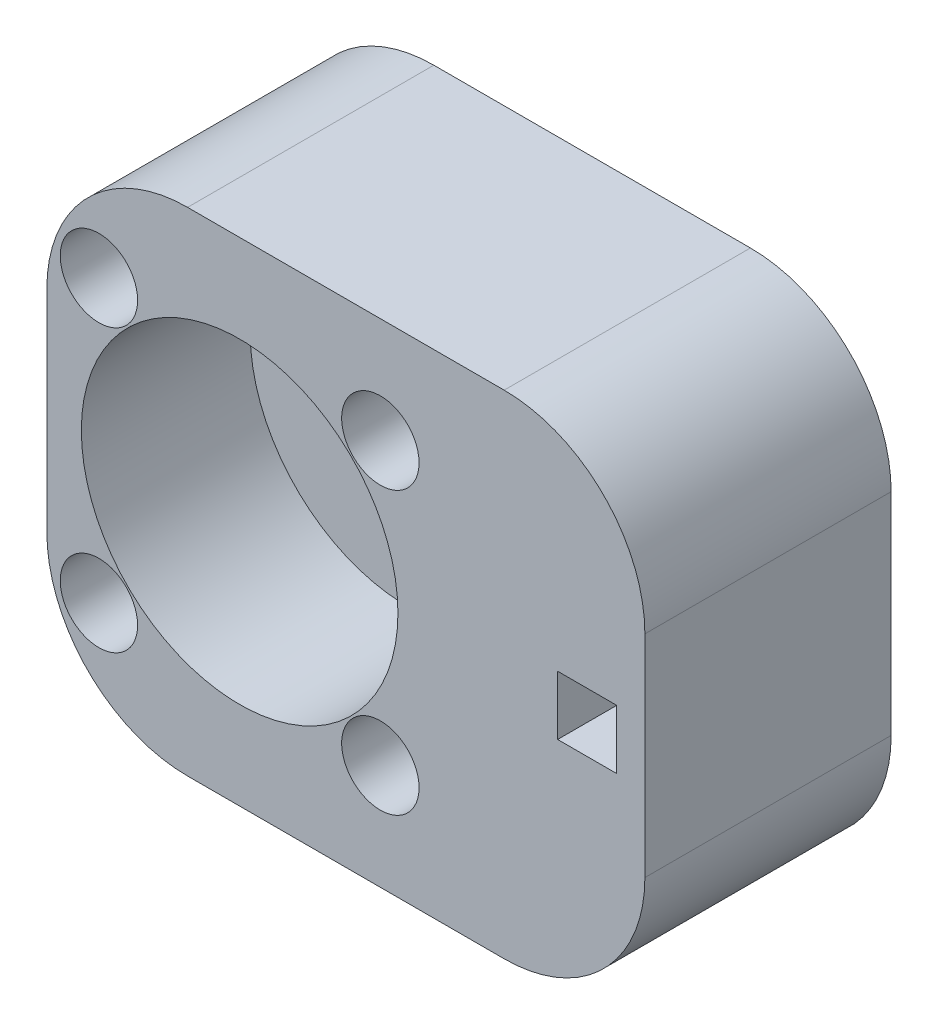
ISO-10303-21;
HEADER;
FILE_DESCRIPTION(('STEP AP214'),'2;1');
FILE_NAME('part.step','',(''),(''),'','','');
FILE_SCHEMA(('AUTOMOTIVE_DESIGN { 1 0 10303 214 1 1 1 1 }'));
ENDSEC;
DATA;
#1=APPLICATION_CONTEXT('core data for automotive mechanical design processes');
#2=APPLICATION_PROTOCOL_DEFINITION('international standard','automotive_design',2000,#1);
#3=PRODUCT_CONTEXT('',#1,'mechanical');
#4=PRODUCT('Part','Part','',(#3));
#5=PRODUCT_RELATED_PRODUCT_CATEGORY('part','',(#4));
#6=PRODUCT_DEFINITION_FORMATION('','',#4);
#7=PRODUCT_DEFINITION_CONTEXT('part definition',#1,'design');
#8=PRODUCT_DEFINITION('design','',#6,#7);
#9=PRODUCT_DEFINITION_SHAPE('','',#8);
#10=(LENGTH_UNIT() NAMED_UNIT(*) SI_UNIT(.MILLI.,.METRE.));
#11=(NAMED_UNIT(*) PLANE_ANGLE_UNIT() SI_UNIT($,.RADIAN.));
#12=(NAMED_UNIT(*) SI_UNIT($,.STERADIAN.) SOLID_ANGLE_UNIT());
#13=UNCERTAINTY_MEASURE_WITH_UNIT(LENGTH_MEASURE(1.E-05),#10,'distance_accuracy_value','');
#14=(GEOMETRIC_REPRESENTATION_CONTEXT(3) GLOBAL_UNCERTAINTY_ASSIGNED_CONTEXT((#13)) GLOBAL_UNIT_ASSIGNED_CONTEXT((#10,
#11,#12)) REPRESENTATION_CONTEXT('',''));
#15=CARTESIAN_POINT('',(0.,0.,0.));
#16=DIRECTION('',(0.,0.,1.));
#17=DIRECTION('',(1.,0.,0.));
#18=AXIS2_PLACEMENT_3D('',#15,#16,#17);
#19=CARTESIAN_POINT('',(382.450010525475,-86.87822296326,0.));
#20=DIRECTION('',(0.,0.,1.));
#21=DIRECTION('',(1.,0.,0.));
#22=AXIS2_PLACEMENT_3D('',#19,#20,#21);
#23=CYLINDRICAL_SURFACE('',#22,1.59999999833988);
#24=CARTESIAN_POINT('',(382.450010525475,-86.87822296326,0.));
#25=DIRECTION('',(0.,0.,1.));
#26=DIRECTION('',(1.,0.,0.));
#27=AXIS2_PLACEMENT_3D('',#24,#25,#26);
#28=CIRCLE('',#27,1.59999999833988);
#29=CARTESIAN_POINT('',(384.050010523815,-86.87822296326,0.));
#30=VERTEX_POINT('',#29);
#31=EDGE_CURVE('E373',#30,#30,#28,.T.);
#32=ORIENTED_EDGE('',*,*,#31,.F.);
#33=EDGE_LOOP('',(#32));
#34=FACE_BOUND('',#33,.T.);
#35=CARTESIAN_POINT('',(382.450010525475,-86.87822296326,2.5));
#36=DIRECTION('',(0.,0.,1.));
#37=DIRECTION('',(1.,0.,0.));
#38=AXIS2_PLACEMENT_3D('',#35,#36,#37);
#39=CIRCLE('',#38,1.59999999833988);
#40=CARTESIAN_POINT('',(384.050010523815,-86.87822296326,2.5));
#41=VERTEX_POINT('',#40);
#42=EDGE_CURVE('E201',#41,#41,#39,.F.);
#43=ORIENTED_EDGE('',*,*,#42,.F.);
#44=EDGE_LOOP('',(#43));
#45=FACE_BOUND('',#44,.T.);
#46=ADVANCED_FACE('F39',(#34,#45),#23,.F.);
#47=CARTESIAN_POINT('',(362.450010525475,-106.87822296326,0.));
#48=DIRECTION('',(0.,0.,1.));
#49=DIRECTION('',(1.,0.,0.));
#50=AXIS2_PLACEMENT_3D('',#47,#48,#49);
#51=CYLINDRICAL_SURFACE('',#50,1.59999999979241);
#52=CARTESIAN_POINT('',(362.450010525475,-106.87822296326,0.));
#53=DIRECTION('',(0.,0.,1.));
#54=DIRECTION('',(1.,0.,0.));
#55=AXIS2_PLACEMENT_3D('',#52,#53,#54);
#56=CIRCLE('',#55,1.59999999979241);
#57=CARTESIAN_POINT('',(364.050010525267,-106.87822296326,0.));
#58=VERTEX_POINT('',#57);
#59=EDGE_CURVE('E204',#58,#58,#56,.T.);
#60=ORIENTED_EDGE('',*,*,#59,.F.);
#61=EDGE_LOOP('',(#60));
#62=FACE_BOUND('',#61,.T.);
#63=CARTESIAN_POINT('',(362.450010525475,-106.87822296326,2.5));
#64=DIRECTION('',(0.,0.,1.));
#65=DIRECTION('',(1.,0.,0.));
#66=AXIS2_PLACEMENT_3D('',#63,#64,#65);
#67=CIRCLE('',#66,1.59999999979241);
#68=CARTESIAN_POINT('',(364.050010525267,-106.87822296326,2.5));
#69=VERTEX_POINT('',#68);
#70=EDGE_CURVE('E198',#69,#69,#67,.F.);
#71=ORIENTED_EDGE('',*,*,#70,.F.);
#72=EDGE_LOOP('',(#71));
#73=FACE_BOUND('',#72,.T.);
#74=ADVANCED_FACE('F270',(#62,#73),#51,.F.);
#75=CARTESIAN_POINT('',(362.450010525475,-86.87822296326,0.));
#76=DIRECTION('',(0.,0.,1.));
#77=DIRECTION('',(1.,0.,0.));
#78=AXIS2_PLACEMENT_3D('',#75,#76,#77);
#79=CYLINDRICAL_SURFACE('',#78,1.59999999833988);
#80=CARTESIAN_POINT('',(362.450010525475,-86.87822296326,0.));
#81=DIRECTION('',(0.,0.,1.));
#82=DIRECTION('',(1.,0.,0.));
#83=AXIS2_PLACEMENT_3D('',#80,#81,#82);
#84=CIRCLE('',#83,1.59999999833988);
#85=CARTESIAN_POINT('',(364.050010523815,-86.87822296326,0.));
#86=VERTEX_POINT('',#85);
#87=EDGE_CURVE('E374',#86,#86,#84,.T.);
#88=ORIENTED_EDGE('',*,*,#87,.F.);
#89=EDGE_LOOP('',(#88));
#90=FACE_BOUND('',#89,.T.);
#91=CARTESIAN_POINT('',(362.450010525475,-86.87822296326,2.5));
#92=DIRECTION('',(0.,0.,1.));
#93=DIRECTION('',(1.,0.,0.));
#94=AXIS2_PLACEMENT_3D('',#91,#92,#93);
#95=CIRCLE('',#94,1.59999999833988);
#96=CARTESIAN_POINT('',(364.050010523815,-86.87822296326,2.5));
#97=VERTEX_POINT('',#96);
#98=EDGE_CURVE('E194',#97,#97,#95,.F.);
#99=ORIENTED_EDGE('',*,*,#98,.F.);
#100=EDGE_LOOP('',(#99));
#101=FACE_BOUND('',#100,.T.);
#102=ADVANCED_FACE('F276',(#90,#101),#79,.F.);
#103=CARTESIAN_POINT('',(382.450010525475,-106.87822296326,0.));
#104=DIRECTION('',(0.,0.,1.));
#105=DIRECTION('',(1.,0.,0.));
#106=AXIS2_PLACEMENT_3D('',#103,#104,#105);
#107=CYLINDRICAL_SURFACE('',#106,1.59999999979246);
#108=CARTESIAN_POINT('',(382.450010525475,-106.87822296326,0.));
#109=DIRECTION('',(0.,0.,1.));
#110=DIRECTION('',(1.,0.,0.));
#111=AXIS2_PLACEMENT_3D('',#108,#109,#110);
#112=CIRCLE('',#111,1.59999999979246);
#113=CARTESIAN_POINT('',(384.050010525267,-106.87822296326,0.));
#114=VERTEX_POINT('',#113);
#115=EDGE_CURVE('E370',#114,#114,#112,.T.);
#116=ORIENTED_EDGE('',*,*,#115,.F.);
#117=EDGE_LOOP('',(#116));
#118=FACE_BOUND('',#117,.T.);
#119=CARTESIAN_POINT('',(382.450010525475,-106.87822296326,2.5));
#120=DIRECTION('',(0.,0.,1.));
#121=DIRECTION('',(1.,0.,0.));
#122=AXIS2_PLACEMENT_3D('',#119,#120,#121);
#123=CIRCLE('',#122,1.59999999979246);
#124=CARTESIAN_POINT('',(384.050010525267,-106.87822296326,2.5));
#125=VERTEX_POINT('',#124);
#126=EDGE_CURVE('E191',#125,#125,#123,.F.);
#127=ORIENTED_EDGE('',*,*,#126,.F.);
#128=EDGE_LOOP('',(#127));
#129=FACE_BOUND('',#128,.T.);
#130=ADVANCED_FACE('F315',(#118,#129),#107,.F.);
#131=CARTESIAN_POINT('',(401.250010525475,-114.37822296326,17.5));
#132=DIRECTION('',(-1.,0.,0.));
#133=DIRECTION('',(0.,0.,1.));
#134=AXIS2_PLACEMENT_3D('',#131,#132,#133);
#135=PLANE('',#134);
#136=DIRECTION('',(0.,1.,0.));
#137=VECTOR('',#136,1.);
#138=CARTESIAN_POINT('',(401.250010525475,-114.37822296326,17.5));
#139=LINE('',#138,#137);
#140=CARTESIAN_POINT('',(401.250010525475,-104.37822296326,17.5));
#141=VERTEX_POINT('',#140);
#142=CARTESIAN_POINT('',(401.250010525475,-89.3782229632599,17.5));
#143=VERTEX_POINT('',#142);
#144=EDGE_CURVE('E168',#141,#143,#139,.T.);
#145=ORIENTED_EDGE('',*,*,#144,.F.);
#146=DIRECTION('',(0.,0.,-1.));
#147=VECTOR('',#146,1.);
#148=CARTESIAN_POINT('',(401.250010525475,-104.37822296326,0.));
#149=LINE('',#148,#147);
#150=CARTESIAN_POINT('',(401.250010525475,-104.37822296326,0.));
#151=VERTEX_POINT('',#150);
#152=EDGE_CURVE('E12',#141,#151,#149,.T.);
#153=ORIENTED_EDGE('',*,*,#152,.T.);
#154=DIRECTION('',(0.,1.,0.));
#155=VECTOR('',#154,1.);
#156=CARTESIAN_POINT('',(401.250010525475,-114.37822296326,0.));
#157=LINE('',#156,#155);
#158=CARTESIAN_POINT('',(401.250010525475,-89.3782229632599,0.));
#159=VERTEX_POINT('',#158);
#160=EDGE_CURVE('E166',#151,#159,#157,.T.);
#161=ORIENTED_EDGE('',*,*,#160,.T.);
#162=DIRECTION('',(0.,0.,-1.));
#163=VECTOR('',#162,1.);
#164=CARTESIAN_POINT('',(401.250010525475,-89.3782229632599,17.5));
#165=LINE('',#164,#163);
#166=EDGE_CURVE('E47',#159,#143,#165,.F.);
#167=ORIENTED_EDGE('',*,*,#166,.T.);
#168=EDGE_LOOP('',(#145,#153,#161,#167));
#169=FACE_BOUND('',#168,.T.);
#170=ADVANCED_FACE('F235',(#169),#135,.F.);
#171=CARTESIAN_POINT('',(401.250010525475,-79.3782229632599,17.5));
#172=DIRECTION('',(0.,-1.,0.));
#173=DIRECTION('',(1.,0.,0.));
#174=AXIS2_PLACEMENT_3D('',#171,#172,#173);
#175=PLANE('',#174);
#176=DIRECTION('',(-1.,0.,0.));
#177=VECTOR('',#176,1.);
#178=CARTESIAN_POINT('',(401.250010525475,-79.3782229632599,0.));
#179=LINE('',#178,#177);
#180=CARTESIAN_POINT('',(391.250010525475,-79.3782229632599,0.));
#181=VERTEX_POINT('',#180);
#182=CARTESIAN_POINT('',(368.750010525475,-79.3782229632599,0.));
#183=VERTEX_POINT('',#182);
#184=EDGE_CURVE('E183',#181,#183,#179,.T.);
#185=ORIENTED_EDGE('',*,*,#184,.T.);
#186=DIRECTION('',(0.,0.,-1.));
#187=VECTOR('',#186,1.);
#188=CARTESIAN_POINT('',(368.750010525475,-79.3782229632599,17.5));
#189=LINE('',#188,#187);
#190=CARTESIAN_POINT('',(368.750010525475,-79.3782229632599,17.5));
#191=VERTEX_POINT('',#190);
#192=EDGE_CURVE('E220',#183,#191,#189,.F.);
#193=ORIENTED_EDGE('',*,*,#192,.T.);
#194=DIRECTION('',(-1.,0.,0.));
#195=VECTOR('',#194,1.);
#196=CARTESIAN_POINT('',(401.250010525475,-79.3782229632599,17.5));
#197=LINE('',#196,#195);
#198=CARTESIAN_POINT('',(391.250010525475,-79.3782229632599,17.5));
#199=VERTEX_POINT('',#198);
#200=EDGE_CURVE('E171',#199,#191,#197,.T.);
#201=ORIENTED_EDGE('',*,*,#200,.F.);
#202=DIRECTION('',(0.,0.,-1.));
#203=VECTOR('',#202,1.);
#204=CARTESIAN_POINT('',(391.250010525475,-79.3782229632599,17.5));
#205=LINE('',#204,#203);
#206=EDGE_CURVE('E217',#199,#181,#205,.T.);
#207=ORIENTED_EDGE('',*,*,#206,.T.);
#208=EDGE_LOOP('',(#185,#193,#201,#207));
#209=FACE_BOUND('',#208,.T.);
#210=ADVANCED_FACE('F245',(#209),#175,.F.);
#211=CARTESIAN_POINT('',(358.750010525475,-114.37822296326,17.5));
#212=DIRECTION('',(-1.,0.,0.));
#213=DIRECTION('',(0.,0.,1.));
#214=AXIS2_PLACEMENT_3D('',#211,#212,#213);
#215=PLANE('',#214);
#216=DIRECTION('',(0.,1.,0.));
#217=VECTOR('',#216,1.);
#218=CARTESIAN_POINT('',(358.750010525475,-114.37822296326,17.5));
#219=LINE('',#218,#217);
#220=CARTESIAN_POINT('',(358.750010525475,-104.37822296326,17.5));
#221=VERTEX_POINT('',#220);
#222=CARTESIAN_POINT('',(358.750010525475,-89.3782229632599,17.5));
#223=VERTEX_POINT('',#222);
#224=EDGE_CURVE('E175',#221,#223,#219,.T.);
#225=ORIENTED_EDGE('',*,*,#224,.T.);
#226=DIRECTION('',(0.,0.,-1.));
#227=VECTOR('',#226,1.);
#228=CARTESIAN_POINT('',(358.750010525475,-89.3782229632599,0.));
#229=LINE('',#228,#227);
#230=CARTESIAN_POINT('',(358.750010525475,-89.3782229632599,0.));
#231=VERTEX_POINT('',#230);
#232=EDGE_CURVE('E206',#223,#231,#229,.T.);
#233=ORIENTED_EDGE('',*,*,#232,.T.);
#234=DIRECTION('',(0.,1.,0.));
#235=VECTOR('',#234,1.);
#236=CARTESIAN_POINT('',(358.750010525475,-114.37822296326,0.));
#237=LINE('',#236,#235);
#238=CARTESIAN_POINT('',(358.750010525475,-104.37822296326,0.));
#239=VERTEX_POINT('',#238);
#240=EDGE_CURVE('E186',#239,#231,#237,.T.);
#241=ORIENTED_EDGE('',*,*,#240,.F.);
#242=DIRECTION('',(0.,0.,-1.));
#243=VECTOR('',#242,1.);
#244=CARTESIAN_POINT('',(358.750010525475,-104.37822296326,17.5));
#245=LINE('',#244,#243);
#246=EDGE_CURVE('E180',#239,#221,#245,.F.);
#247=ORIENTED_EDGE('',*,*,#246,.T.);
#248=EDGE_LOOP('',(#225,#233,#241,#247));
#249=FACE_BOUND('',#248,.T.);
#250=ADVANCED_FACE('F255',(#249),#215,.T.);
#251=CARTESIAN_POINT('',(401.250010525475,-114.37822296326,17.5));
#252=DIRECTION('',(0.,-1.,0.));
#253=DIRECTION('',(0.,0.,-1.));
#254=AXIS2_PLACEMENT_3D('',#251,#252,#253);
#255=PLANE('',#254);
#256=DIRECTION('',(-1.,0.,0.));
#257=VECTOR('',#256,1.);
#258=CARTESIAN_POINT('',(401.250010525475,-114.37822296326,17.5));
#259=LINE('',#258,#257);
#260=CARTESIAN_POINT('',(391.250010525475,-114.37822296326,17.5));
#261=VERTEX_POINT('',#260);
#262=CARTESIAN_POINT('',(368.750010525475,-114.37822296326,17.5));
#263=VERTEX_POINT('',#262);
#264=EDGE_CURVE('E178',#261,#263,#259,.T.);
#265=ORIENTED_EDGE('',*,*,#264,.T.);
#266=DIRECTION('',(0.,0.,-1.));
#267=VECTOR('',#266,1.);
#268=CARTESIAN_POINT('',(368.750010525475,-114.37822296326,17.5));
#269=LINE('',#268,#267);
#270=CARTESIAN_POINT('',(368.750010525475,-114.37822296326,0.));
#271=VERTEX_POINT('',#270);
#272=EDGE_CURVE('E230',#263,#271,#269,.T.);
#273=ORIENTED_EDGE('',*,*,#272,.T.);
#274=DIRECTION('',(-1.,0.,0.));
#275=VECTOR('',#274,1.);
#276=CARTESIAN_POINT('',(401.250010525475,-114.37822296326,0.));
#277=LINE('',#276,#275);
#278=CARTESIAN_POINT('',(391.250010525475,-114.37822296326,0.));
#279=VERTEX_POINT('',#278);
#280=EDGE_CURVE('E172',#279,#271,#277,.T.);
#281=ORIENTED_EDGE('',*,*,#280,.F.);
#282=DIRECTION('',(0.,0.,-1.));
#283=VECTOR('',#282,1.);
#284=CARTESIAN_POINT('',(391.250010525475,-114.37822296326,17.5));
#285=LINE('',#284,#283);
#286=EDGE_CURVE('E61',#279,#261,#285,.F.);
#287=ORIENTED_EDGE('',*,*,#286,.T.);
#288=EDGE_LOOP('',(#265,#273,#281,#287));
#289=FACE_BOUND('',#288,.T.);
#290=ADVANCED_FACE('F260',(#289),#255,.T.);
#291=CARTESIAN_POINT('',(0.,0.,17.5));
#292=DIRECTION('',(0.,0.,1.));
#293=DIRECTION('',(1.,0.,0.));
#294=AXIS2_PLACEMENT_3D('',#291,#292,#293);
#295=PLANE('',#294);
#296=CARTESIAN_POINT('',(372.450010525475,-96.87822296326,17.5));
#297=DIRECTION('',(0.,0.,1.));
#298=DIRECTION('',(1.,0.,0.));
#299=AXIS2_PLACEMENT_3D('',#296,#297,#298);
#300=CIRCLE('',#299,11.2499999997924);
#301=CARTESIAN_POINT('',(383.700010525267,-96.87822296326,17.5));
#302=VERTEX_POINT('',#301);
#303=EDGE_CURVE('E414',#302,#302,#300,.T.);
#304=ORIENTED_EDGE('',*,*,#303,.F.);
#305=EDGE_LOOP('',(#304));
#306=FACE_BOUND('',#305,.T.);
#307=CARTESIAN_POINT('',(362.450010525475,-106.87822296326,17.5));
#308=DIRECTION('',(0.,0.,1.));
#309=DIRECTION('',(1.,0.,0.));
#310=AXIS2_PLACEMENT_3D('',#307,#308,#309);
#311=CIRCLE('',#310,2.74999999979247);
#312=CARTESIAN_POINT('',(365.200010525267,-106.87822296326,17.5));
#313=VERTEX_POINT('',#312);
#314=EDGE_CURVE('E396',#313,#313,#311,.T.);
#315=ORIENTED_EDGE('',*,*,#314,.F.);
#316=EDGE_LOOP('',(#315));
#317=FACE_BOUND('',#316,.T.);
#318=CARTESIAN_POINT('',(362.450010525475,-86.87822296326,17.5));
#319=DIRECTION('',(0.,0.,1.));
#320=DIRECTION('',(1.,0.,0.));
#321=AXIS2_PLACEMENT_3D('',#318,#319,#320);
#322=CIRCLE('',#321,2.74999999979247);
#323=CARTESIAN_POINT('',(365.200010525267,-86.87822296326,17.5));
#324=VERTEX_POINT('',#323);
#325=EDGE_CURVE('E404',#324,#324,#322,.T.);
#326=ORIENTED_EDGE('',*,*,#325,.F.);
#327=EDGE_LOOP('',(#326));
#328=FACE_BOUND('',#327,.T.);
#329=CARTESIAN_POINT('',(382.450010525475,-86.87822296326,17.5));
#330=DIRECTION('',(0.,0.,1.));
#331=DIRECTION('',(1.,0.,0.));
#332=AXIS2_PLACEMENT_3D('',#329,#330,#331);
#333=CIRCLE('',#332,2.74999999979247);
#334=CARTESIAN_POINT('',(385.200010525267,-86.87822296326,17.5));
#335=VERTEX_POINT('',#334);
#336=EDGE_CURVE('E395',#335,#335,#333,.T.);
#337=ORIENTED_EDGE('',*,*,#336,.F.);
#338=EDGE_LOOP('',(#337));
#339=FACE_BOUND('',#338,.T.);
#340=CARTESIAN_POINT('',(382.450010525475,-106.87822296326,17.5));
#341=DIRECTION('',(0.,0.,1.));
#342=DIRECTION('',(1.,0.,0.));
#343=AXIS2_PLACEMENT_3D('',#340,#341,#342);
#344=CIRCLE('',#343,2.74999999979242);
#345=CARTESIAN_POINT('',(385.200010525267,-106.87822296326,17.5));
#346=VERTEX_POINT('',#345);
#347=EDGE_CURVE('E392',#346,#346,#344,.T.);
#348=ORIENTED_EDGE('',*,*,#347,.F.);
#349=EDGE_LOOP('',(#348));
#350=FACE_BOUND('',#349,.T.);
#351=DIRECTION('',(0.,-1.,0.));
#352=VECTOR('',#351,1.);
#353=CARTESIAN_POINT('',(395.050010525475,-98.9782229632614,17.5));
#354=LINE('',#353,#352);
#355=CARTESIAN_POINT('',(395.050010525475,-94.7782229632615,17.5));
#356=VERTEX_POINT('',#355);
#357=CARTESIAN_POINT('',(395.050010525475,-98.9782229632614,17.5));
#358=VERTEX_POINT('',#357);
#359=EDGE_CURVE('E151',#356,#358,#354,.T.);
#360=ORIENTED_EDGE('',*,*,#359,.F.);
#361=DIRECTION('',(-1.,0.,0.));
#362=VECTOR('',#361,1.);
#363=CARTESIAN_POINT('',(399.250010525475,-94.7782229632615,17.5));
#364=LINE('',#363,#362);
#365=CARTESIAN_POINT('',(399.250010525475,-94.7782229632615,17.5));
#366=VERTEX_POINT('',#365);
#367=EDGE_CURVE('E155',#366,#356,#364,.T.);
#368=ORIENTED_EDGE('',*,*,#367,.F.);
#369=DIRECTION('',(0.,1.,0.));
#370=VECTOR('',#369,1.);
#371=CARTESIAN_POINT('',(399.250010525475,-98.9782229632614,17.5));
#372=LINE('',#371,#370);
#373=CARTESIAN_POINT('',(399.250010525475,-98.9782229632614,17.5));
#374=VERTEX_POINT('',#373);
#375=EDGE_CURVE('E135',#374,#366,#372,.T.);
#376=ORIENTED_EDGE('',*,*,#375,.F.);
#377=DIRECTION('',(1.,0.,0.));
#378=VECTOR('',#377,1.);
#379=CARTESIAN_POINT('',(399.250010525475,-98.9782229632614,17.5));
#380=LINE('',#379,#378);
#381=EDGE_CURVE('E146',#358,#374,#380,.T.);
#382=ORIENTED_EDGE('',*,*,#381,.F.);
#383=EDGE_LOOP('',(#360,#368,#376,#382));
#384=FACE_BOUND('',#383,.T.);
#385=ORIENTED_EDGE('',*,*,#200,.T.);
#386=CARTESIAN_POINT('',(368.750010525475,-89.3782229632599,17.5));
#387=DIRECTION('',(0.,0.,1.));
#388=DIRECTION('',(1.,0.,0.));
#389=AXIS2_PLACEMENT_3D('',#386,#387,#388);
#390=CIRCLE('',#389,10.);
#391=EDGE_CURVE('E227',#191,#223,#390,.T.);
#392=ORIENTED_EDGE('',*,*,#391,.T.);
#393=ORIENTED_EDGE('',*,*,#224,.F.);
#394=CARTESIAN_POINT('',(368.750010525475,-104.37822296326,17.5));
#395=DIRECTION('',(0.,0.,1.));
#396=DIRECTION('',(1.,0.,0.));
#397=AXIS2_PLACEMENT_3D('',#394,#395,#396);
#398=CIRCLE('',#397,10.);
#399=EDGE_CURVE('E54',#221,#263,#398,.T.);
#400=ORIENTED_EDGE('',*,*,#399,.T.);
#401=ORIENTED_EDGE('',*,*,#264,.F.);
#402=CARTESIAN_POINT('',(391.250010525475,-104.37822296326,17.5));
#403=DIRECTION('',(0.,0.,1.));
#404=DIRECTION('',(1.,0.,0.));
#405=AXIS2_PLACEMENT_3D('',#402,#403,#404);
#406=CIRCLE('',#405,10.);
#407=EDGE_CURVE('E224',#261,#141,#406,.T.);
#408=ORIENTED_EDGE('',*,*,#407,.T.);
#409=ORIENTED_EDGE('',*,*,#144,.T.);
#410=CARTESIAN_POINT('',(391.250010525475,-89.3782229632599,17.5));
#411=DIRECTION('',(0.,0.,1.));
#412=DIRECTION('',(1.,0.,0.));
#413=AXIS2_PLACEMENT_3D('',#410,#411,#412);
#414=CIRCLE('',#413,10.);
#415=EDGE_CURVE('E222',#143,#199,#414,.T.);
#416=ORIENTED_EDGE('',*,*,#415,.T.);
#417=EDGE_LOOP('',(#385,#392,#393,#400,#401,#408,#409,#416));
#418=FACE_BOUND('',#417,.T.);
#419=ADVANCED_FACE('F153',(#306,#317,#328,#339,#350,#384,#418),#295,.T.);
#420=CARTESIAN_POINT('',(0.,0.,0.));
#421=DIRECTION('',(0.,0.,1.));
#422=DIRECTION('',(1.,0.,0.));
#423=AXIS2_PLACEMENT_3D('',#420,#421,#422);
#424=PLANE('',#423);
#425=ORIENTED_EDGE('',*,*,#115,.T.);
#426=EDGE_LOOP('',(#425));
#427=FACE_BOUND('',#426,.T.);
#428=ORIENTED_EDGE('',*,*,#87,.T.);
#429=EDGE_LOOP('',(#428));
#430=FACE_BOUND('',#429,.T.);
#431=ORIENTED_EDGE('',*,*,#59,.T.);
#432=EDGE_LOOP('',(#431));
#433=FACE_BOUND('',#432,.T.);
#434=ORIENTED_EDGE('',*,*,#31,.T.);
#435=EDGE_LOOP('',(#434));
#436=FACE_BOUND('',#435,.T.);
#437=ORIENTED_EDGE('',*,*,#240,.T.);
#438=CARTESIAN_POINT('',(368.750010525475,-89.3782229632599,0.));
#439=DIRECTION('',(0.,0.,1.));
#440=DIRECTION('',(1.,0.,0.));
#441=AXIS2_PLACEMENT_3D('',#438,#439,#440);
#442=CIRCLE('',#441,10.);
#443=EDGE_CURVE('E215',#231,#183,#442,.F.);
#444=ORIENTED_EDGE('',*,*,#443,.T.);
#445=ORIENTED_EDGE('',*,*,#184,.F.);
#446=CARTESIAN_POINT('',(391.250010525475,-89.3782229632599,0.));
#447=DIRECTION('',(0.,0.,1.));
#448=DIRECTION('',(1.,0.,0.));
#449=AXIS2_PLACEMENT_3D('',#446,#447,#448);
#450=CIRCLE('',#449,10.);
#451=EDGE_CURVE('E209',#181,#159,#450,.F.);
#452=ORIENTED_EDGE('',*,*,#451,.T.);
#453=ORIENTED_EDGE('',*,*,#160,.F.);
#454=CARTESIAN_POINT('',(391.250010525475,-104.37822296326,0.));
#455=DIRECTION('',(0.,0.,1.));
#456=DIRECTION('',(1.,0.,0.));
#457=AXIS2_PLACEMENT_3D('',#454,#455,#456);
#458=CIRCLE('',#457,10.);
#459=EDGE_CURVE('E211',#151,#279,#458,.F.);
#460=ORIENTED_EDGE('',*,*,#459,.T.);
#461=ORIENTED_EDGE('',*,*,#280,.T.);
#462=CARTESIAN_POINT('',(368.750010525475,-104.37822296326,0.));
#463=DIRECTION('',(0.,0.,1.));
#464=DIRECTION('',(1.,0.,0.));
#465=AXIS2_PLACEMENT_3D('',#462,#463,#464);
#466=CIRCLE('',#465,10.);
#467=EDGE_CURVE('E213',#271,#239,#466,.F.);
#468=ORIENTED_EDGE('',*,*,#467,.T.);
#469=EDGE_LOOP('',(#437,#444,#445,#452,#453,#460,#461,#468));
#470=FACE_BOUND('',#469,.T.);
#471=ADVANCED_FACE('F248',(#427,#430,#433,#436,#470),#424,.F.);
#472=CARTESIAN_POINT('',(395.050010525475,-98.9782229632614,-5.93969696196697));
#473=DIRECTION('',(-1.,0.,0.));
#474=DIRECTION('',(0.,0.,1.));
#475=AXIS2_PLACEMENT_3D('',#472,#473,#474);
#476=PLANE('',#475);
#477=DIRECTION('',(0.,1.,0.));
#478=VECTOR('',#477,1.);
#479=CARTESIAN_POINT('',(395.050010525475,-98.9782229632614,5.));
#480=LINE('',#479,#478);
#481=CARTESIAN_POINT('',(395.050010525475,-98.9782229632614,5.));
#482=VERTEX_POINT('',#481);
#483=CARTESIAN_POINT('',(395.050010525475,-94.7782229632615,5.));
#484=VERTEX_POINT('',#483);
#485=EDGE_CURVE('E167',#482,#484,#480,.T.);
#486=ORIENTED_EDGE('',*,*,#485,.T.);
#487=DIRECTION('',(0.,0.,1.));
#488=VECTOR('',#487,1.);
#489=CARTESIAN_POINT('',(395.050010525475,-94.7782229632615,-5.93969696196697));
#490=LINE('',#489,#488);
#491=EDGE_CURVE('E160',#484,#356,#490,.T.);
#492=ORIENTED_EDGE('',*,*,#491,.T.);
#493=ORIENTED_EDGE('',*,*,#359,.T.);
#494=DIRECTION('',(0.,0.,1.));
#495=VECTOR('',#494,1.);
#496=CARTESIAN_POINT('',(395.050010525475,-98.9782229632614,-5.93969696196697));
#497=LINE('',#496,#495);
#498=EDGE_CURVE('E142',#482,#358,#497,.T.);
#499=ORIENTED_EDGE('',*,*,#498,.F.);
#500=EDGE_LOOP('',(#486,#492,#493,#499));
#501=FACE_BOUND('',#500,.T.);
#502=ADVANCED_FACE('F292',(#501),#476,.F.);
#503=CARTESIAN_POINT('',(399.250010525475,-94.7782229632615,-5.93969696196697));
#504=DIRECTION('',(0.,1.,0.));
#505=DIRECTION('',(0.,0.,1.));
#506=AXIS2_PLACEMENT_3D('',#503,#504,#505);
#507=PLANE('',#506);
#508=DIRECTION('',(1.,0.,0.));
#509=VECTOR('',#508,1.);
#510=CARTESIAN_POINT('',(399.250010525475,-94.7782229632615,5.));
#511=LINE('',#510,#509);
#512=CARTESIAN_POINT('',(399.250010525475,-94.7782229632615,5.));
#513=VERTEX_POINT('',#512);
#514=EDGE_CURVE('E384',#484,#513,#511,.T.);
#515=ORIENTED_EDGE('',*,*,#514,.T.);
#516=DIRECTION('',(0.,0.,1.));
#517=VECTOR('',#516,1.);
#518=CARTESIAN_POINT('',(399.250010525475,-94.7782229632615,-5.93969696196697));
#519=LINE('',#518,#517);
#520=EDGE_CURVE('E141',#513,#366,#519,.T.);
#521=ORIENTED_EDGE('',*,*,#520,.T.);
#522=ORIENTED_EDGE('',*,*,#367,.T.);
#523=ORIENTED_EDGE('',*,*,#491,.F.);
#524=EDGE_LOOP('',(#515,#521,#522,#523));
#525=FACE_BOUND('',#524,.T.);
#526=ADVANCED_FACE('F289',(#525),#507,.F.);
#527=CARTESIAN_POINT('',(399.250010525475,-98.9782229632614,-5.93969696196697));
#528=DIRECTION('',(1.,0.,0.));
#529=DIRECTION('',(0.,0.,-1.));
#530=AXIS2_PLACEMENT_3D('',#527,#528,#529);
#531=PLANE('',#530);
#532=DIRECTION('',(0.,-1.,0.));
#533=VECTOR('',#532,1.);
#534=CARTESIAN_POINT('',(399.250010525475,-98.9782229632614,5.));
#535=LINE('',#534,#533);
#536=CARTESIAN_POINT('',(399.250010525475,-98.9782229632614,5.));
#537=VERTEX_POINT('',#536);
#538=EDGE_CURVE('E138',#513,#537,#535,.T.);
#539=ORIENTED_EDGE('',*,*,#538,.T.);
#540=DIRECTION('',(0.,0.,1.));
#541=VECTOR('',#540,1.);
#542=CARTESIAN_POINT('',(399.250010525475,-98.9782229632614,-5.93969696196697));
#543=LINE('',#542,#541);
#544=EDGE_CURVE('E130',#537,#374,#543,.T.);
#545=ORIENTED_EDGE('',*,*,#544,.T.);
#546=ORIENTED_EDGE('',*,*,#375,.T.);
#547=ORIENTED_EDGE('',*,*,#520,.F.);
#548=EDGE_LOOP('',(#539,#545,#546,#547));
#549=FACE_BOUND('',#548,.T.);
#550=ADVANCED_FACE('F132',(#549),#531,.F.);
#551=CARTESIAN_POINT('',(399.250010525475,-98.9782229632614,-5.93969696196697));
#552=DIRECTION('',(0.,-1.,0.));
#553=DIRECTION('',(0.,0.,-1.));
#554=AXIS2_PLACEMENT_3D('',#551,#552,#553);
#555=PLANE('',#554);
#556=DIRECTION('',(-1.,0.,0.));
#557=VECTOR('',#556,1.);
#558=CARTESIAN_POINT('',(399.250010525475,-98.9782229632614,5.));
#559=LINE('',#558,#557);
#560=EDGE_CURVE('E164',#537,#482,#559,.T.);
#561=ORIENTED_EDGE('',*,*,#560,.T.);
#562=ORIENTED_EDGE('',*,*,#498,.T.);
#563=ORIENTED_EDGE('',*,*,#381,.T.);
#564=ORIENTED_EDGE('',*,*,#544,.F.);
#565=EDGE_LOOP('',(#561,#562,#563,#564));
#566=FACE_BOUND('',#565,.T.);
#567=ADVANCED_FACE('F147',(#566),#555,.F.);
#568=CARTESIAN_POINT('',(0.,0.,5.));
#569=DIRECTION('',(0.,0.,1.));
#570=DIRECTION('',(1.,0.,0.));
#571=AXIS2_PLACEMENT_3D('',#568,#569,#570);
#572=PLANE('',#571);
#573=ORIENTED_EDGE('',*,*,#485,.F.);
#574=ORIENTED_EDGE('',*,*,#560,.F.);
#575=ORIENTED_EDGE('',*,*,#538,.F.);
#576=ORIENTED_EDGE('',*,*,#514,.F.);
#577=EDGE_LOOP('',(#573,#574,#575,#576));
#578=FACE_BOUND('',#577,.T.);
#579=ADVANCED_FACE('F284',(#578),#572,.T.);
#580=CARTESIAN_POINT('',(0.,0.,2.5));
#581=DIRECTION('',(0.,0.,1.));
#582=DIRECTION('',(1.,0.,0.));
#583=AXIS2_PLACEMENT_3D('',#580,#581,#582);
#584=PLANE('',#583);
#585=CARTESIAN_POINT('',(382.450010525475,-106.87822296326,2.5));
#586=DIRECTION('',(0.,0.,1.));
#587=DIRECTION('',(1.,0.,0.));
#588=AXIS2_PLACEMENT_3D('',#585,#586,#587);
#589=CIRCLE('',#588,2.74999999979242);
#590=CARTESIAN_POINT('',(385.200010525267,-106.87822296326,2.5));
#591=VERTEX_POINT('',#590);
#592=EDGE_CURVE('E195',#591,#591,#589,.F.);
#593=ORIENTED_EDGE('',*,*,#592,.F.);
#594=EDGE_LOOP('',(#593));
#595=FACE_BOUND('',#594,.T.);
#596=ORIENTED_EDGE('',*,*,#126,.T.);
#597=EDGE_LOOP('',(#596));
#598=FACE_BOUND('',#597,.T.);
#599=ADVANCED_FACE('F287',(#595,#598),#584,.T.);
#600=CARTESIAN_POINT('',(382.450010525475,-106.87822296326,-7.77817459246505));
#601=DIRECTION('',(0.,0.,1.));
#602=DIRECTION('',(1.,0.,0.));
#603=AXIS2_PLACEMENT_3D('',#600,#601,#602);
#604=CYLINDRICAL_SURFACE('',#603,2.74999999979242);
#605=ORIENTED_EDGE('',*,*,#592,.T.);
#606=EDGE_LOOP('',(#605));
#607=FACE_BOUND('',#606,.T.);
#608=ORIENTED_EDGE('',*,*,#347,.T.);
#609=EDGE_LOOP('',(#608));
#610=FACE_BOUND('',#609,.T.);
#611=ADVANCED_FACE('F348',(#607,#610),#604,.F.);
#612=CARTESIAN_POINT('',(0.,0.,2.5));
#613=DIRECTION('',(0.,0.,1.));
#614=DIRECTION('',(1.,0.,0.));
#615=AXIS2_PLACEMENT_3D('',#612,#613,#614);
#616=PLANE('',#615);
#617=CARTESIAN_POINT('',(362.450010525475,-86.87822296326,2.5));
#618=DIRECTION('',(0.,0.,1.));
#619=DIRECTION('',(1.,0.,0.));
#620=AXIS2_PLACEMENT_3D('',#617,#618,#619);
#621=CIRCLE('',#620,2.74999999979247);
#622=CARTESIAN_POINT('',(365.200010525267,-86.87822296326,2.5));
#623=VERTEX_POINT('',#622);
#624=EDGE_CURVE('E399',#623,#623,#621,.F.);
#625=ORIENTED_EDGE('',*,*,#624,.F.);
#626=EDGE_LOOP('',(#625));
#627=FACE_BOUND('',#626,.T.);
#628=ORIENTED_EDGE('',*,*,#98,.T.);
#629=EDGE_LOOP('',(#628));
#630=FACE_BOUND('',#629,.T.);
#631=ADVANCED_FACE('F344',(#627,#630),#616,.T.);
#632=CARTESIAN_POINT('',(362.450010525475,-86.87822296326,-7.77817459246505));
#633=DIRECTION('',(0.,0.,1.));
#634=DIRECTION('',(1.,0.,0.));
#635=AXIS2_PLACEMENT_3D('',#632,#633,#634);
#636=CYLINDRICAL_SURFACE('',#635,2.74999999979247);
#637=ORIENTED_EDGE('',*,*,#624,.T.);
#638=EDGE_LOOP('',(#637));
#639=FACE_BOUND('',#638,.T.);
#640=ORIENTED_EDGE('',*,*,#325,.T.);
#641=EDGE_LOOP('',(#640));
#642=FACE_BOUND('',#641,.T.);
#643=ADVANCED_FACE('F340',(#639,#642),#636,.F.);
#644=CARTESIAN_POINT('',(0.,0.,2.5));
#645=DIRECTION('',(0.,0.,1.));
#646=DIRECTION('',(1.,0.,0.));
#647=AXIS2_PLACEMENT_3D('',#644,#645,#646);
#648=PLANE('',#647);
#649=CARTESIAN_POINT('',(362.450010525475,-106.87822296326,2.5));
#650=DIRECTION('',(0.,0.,1.));
#651=DIRECTION('',(1.,0.,0.));
#652=AXIS2_PLACEMENT_3D('',#649,#650,#651);
#653=CIRCLE('',#652,2.74999999979247);
#654=CARTESIAN_POINT('',(365.200010525267,-106.87822296326,2.5));
#655=VERTEX_POINT('',#654);
#656=EDGE_CURVE('E400',#655,#655,#653,.F.);
#657=ORIENTED_EDGE('',*,*,#656,.F.);
#658=EDGE_LOOP('',(#657));
#659=FACE_BOUND('',#658,.T.);
#660=ORIENTED_EDGE('',*,*,#70,.T.);
#661=EDGE_LOOP('',(#660));
#662=FACE_BOUND('',#661,.T.);
#663=ADVANCED_FACE('F343',(#659,#662),#648,.T.);
#664=CARTESIAN_POINT('',(362.450010525475,-106.87822296326,-7.77817459246505));
#665=DIRECTION('',(0.,0.,1.));
#666=DIRECTION('',(1.,0.,0.));
#667=AXIS2_PLACEMENT_3D('',#664,#665,#666);
#668=CYLINDRICAL_SURFACE('',#667,2.74999999979247);
#669=ORIENTED_EDGE('',*,*,#656,.T.);
#670=EDGE_LOOP('',(#669));
#671=FACE_BOUND('',#670,.T.);
#672=ORIENTED_EDGE('',*,*,#314,.T.);
#673=EDGE_LOOP('',(#672));
#674=FACE_BOUND('',#673,.T.);
#675=ADVANCED_FACE('F338',(#671,#674),#668,.F.);
#676=CARTESIAN_POINT('',(0.,0.,2.5));
#677=DIRECTION('',(0.,0.,1.));
#678=DIRECTION('',(1.,0.,0.));
#679=AXIS2_PLACEMENT_3D('',#676,#677,#678);
#680=PLANE('',#679);
#681=CARTESIAN_POINT('',(382.450010525475,-86.87822296326,2.5));
#682=DIRECTION('',(0.,0.,1.));
#683=DIRECTION('',(1.,0.,0.));
#684=AXIS2_PLACEMENT_3D('',#681,#682,#683);
#685=CIRCLE('',#684,2.74999999979247);
#686=CARTESIAN_POINT('',(385.200010525267,-86.87822296326,2.5));
#687=VERTEX_POINT('',#686);
#688=EDGE_CURVE('E407',#687,#687,#685,.F.);
#689=ORIENTED_EDGE('',*,*,#688,.F.);
#690=EDGE_LOOP('',(#689));
#691=FACE_BOUND('',#690,.T.);
#692=ORIENTED_EDGE('',*,*,#42,.T.);
#693=EDGE_LOOP('',(#692));
#694=FACE_BOUND('',#693,.T.);
#695=ADVANCED_FACE('F334',(#691,#694),#680,.T.);
#696=CARTESIAN_POINT('',(382.450010525475,-86.87822296326,-7.77817459246505));
#697=DIRECTION('',(0.,0.,1.));
#698=DIRECTION('',(1.,0.,0.));
#699=AXIS2_PLACEMENT_3D('',#696,#697,#698);
#700=CYLINDRICAL_SURFACE('',#699,2.74999999979247);
#701=ORIENTED_EDGE('',*,*,#688,.T.);
#702=EDGE_LOOP('',(#701));
#703=FACE_BOUND('',#702,.T.);
#704=ORIENTED_EDGE('',*,*,#336,.T.);
#705=EDGE_LOOP('',(#704));
#706=FACE_BOUND('',#705,.T.);
#707=ADVANCED_FACE('F327',(#703,#706),#700,.F.);
#708=CARTESIAN_POINT('',(372.450010525475,-96.87822296326,5.5));
#709=DIRECTION('',(0.,0.,1.));
#710=DIRECTION('',(1.,0.,0.));
#711=AXIS2_PLACEMENT_3D('',#708,#709,#710);
#712=CYLINDRICAL_SURFACE('',#711,11.2499999997924);
#713=CARTESIAN_POINT('',(372.450010525475,-96.87822296326,5.5));
#714=DIRECTION('',(0.,0.,1.));
#715=DIRECTION('',(1.,0.,0.));
#716=AXIS2_PLACEMENT_3D('',#713,#714,#715);
#717=CIRCLE('',#716,11.2499999997924);
#718=CARTESIAN_POINT('',(383.700010525267,-96.87822296326,5.5));
#719=VERTEX_POINT('',#718);
#720=EDGE_CURVE('E403',#719,#719,#717,.T.);
#721=ORIENTED_EDGE('',*,*,#720,.F.);
#722=EDGE_LOOP('',(#721));
#723=FACE_BOUND('',#722,.T.);
#724=ORIENTED_EDGE('',*,*,#303,.T.);
#725=EDGE_LOOP('',(#724));
#726=FACE_BOUND('',#725,.T.);
#727=ADVANCED_FACE('F321',(#723,#726),#712,.F.);
#728=CARTESIAN_POINT('',(372.450010525475,-96.87822296326,5.5));
#729=DIRECTION('',(0.,0.,1.));
#730=DIRECTION('',(1.,0.,0.));
#731=AXIS2_PLACEMENT_3D('',#728,#729,#730);
#732=PLANE('',#731);
#733=ORIENTED_EDGE('',*,*,#720,.T.);
#734=EDGE_LOOP('',(#733));
#735=FACE_BOUND('',#734,.T.);
#736=ADVANCED_FACE('F317',(#735),#732,.T.);
#737=CARTESIAN_POINT('',(368.750010525475,-89.3782229632599,17.5));
#738=DIRECTION('',(0.,0.,1.));
#739=DIRECTION('',(1.,0.,0.));
#740=AXIS2_PLACEMENT_3D('',#737,#738,#739);
#741=CYLINDRICAL_SURFACE('',#740,10.);
#742=ORIENTED_EDGE('',*,*,#391,.F.);
#743=ORIENTED_EDGE('',*,*,#192,.F.);
#744=ORIENTED_EDGE('',*,*,#443,.F.);
#745=ORIENTED_EDGE('',*,*,#232,.F.);
#746=EDGE_LOOP('',(#742,#743,#744,#745));
#747=FACE_BOUND('',#746,.T.);
#748=ADVANCED_FACE('F253',(#747),#741,.T.);
#749=CARTESIAN_POINT('',(368.750010525475,-104.37822296326,17.5));
#750=DIRECTION('',(0.,0.,-1.));
#751=DIRECTION('',(-1.,0.,0.));
#752=AXIS2_PLACEMENT_3D('',#749,#750,#751);
#753=CYLINDRICAL_SURFACE('',#752,10.);
#754=ORIENTED_EDGE('',*,*,#399,.F.);
#755=ORIENTED_EDGE('',*,*,#246,.F.);
#756=ORIENTED_EDGE('',*,*,#467,.F.);
#757=ORIENTED_EDGE('',*,*,#272,.F.);
#758=EDGE_LOOP('',(#754,#755,#756,#757));
#759=FACE_BOUND('',#758,.T.);
#760=ADVANCED_FACE('F259',(#759),#753,.T.);
#761=CARTESIAN_POINT('',(391.250010525475,-104.37822296326,17.5));
#762=DIRECTION('',(0.,0.,1.));
#763=DIRECTION('',(1.,0.,0.));
#764=AXIS2_PLACEMENT_3D('',#761,#762,#763);
#765=CYLINDRICAL_SURFACE('',#764,10.);
#766=ORIENTED_EDGE('',*,*,#407,.F.);
#767=ORIENTED_EDGE('',*,*,#286,.F.);
#768=ORIENTED_EDGE('',*,*,#459,.F.);
#769=ORIENTED_EDGE('',*,*,#152,.F.);
#770=EDGE_LOOP('',(#766,#767,#768,#769));
#771=FACE_BOUND('',#770,.T.);
#772=ADVANCED_FACE('F262',(#771),#765,.T.);
#773=CARTESIAN_POINT('',(391.250010525475,-89.3782229632599,17.5));
#774=DIRECTION('',(0.,0.,-1.));
#775=DIRECTION('',(-1.,0.,0.));
#776=AXIS2_PLACEMENT_3D('',#773,#774,#775);
#777=CYLINDRICAL_SURFACE('',#776,10.);
#778=ORIENTED_EDGE('',*,*,#415,.F.);
#779=ORIENTED_EDGE('',*,*,#166,.F.);
#780=ORIENTED_EDGE('',*,*,#451,.F.);
#781=ORIENTED_EDGE('',*,*,#206,.F.);
#782=EDGE_LOOP('',(#778,#779,#780,#781));
#783=FACE_BOUND('',#782,.T.);
#784=ADVANCED_FACE('F41',(#783),#777,.T.);
#785=CLOSED_SHELL('',(#46,#74,#102,#130,#170,#210,#250,#290,#419,#471,#502,#526,#550,#567,#579,
#599,#611,#631,#643,#663,#675,#695,#707,#727,#736,#748,#760,#772,#784));
#786=MANIFOLD_SOLID_BREP('B2',#785);
#787=ADVANCED_BREP_SHAPE_REPRESENTATION('',(#18,#786),#14);
#788=SHAPE_DEFINITION_REPRESENTATION(#9,#787);
ENDSEC;
END-ISO-10303-21;
